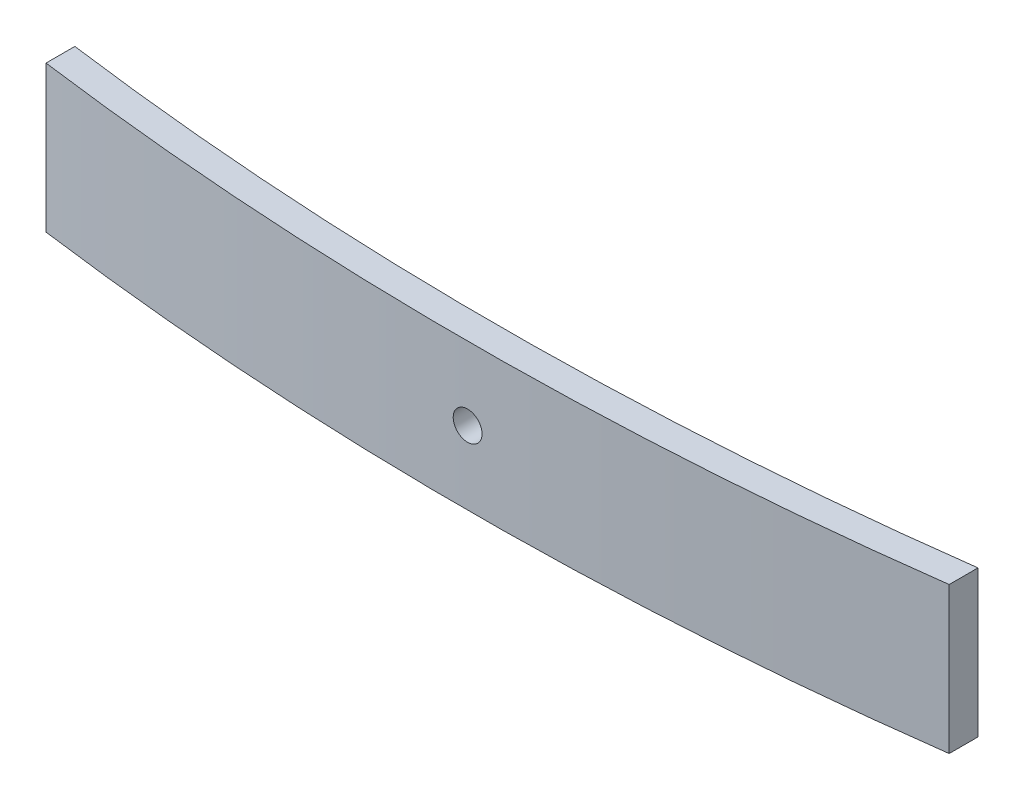
ISO-10303-21;
HEADER;
FILE_DESCRIPTION(('STEP AP214'),'2;1');
FILE_NAME('part.step','',(''),(''),'','','');
FILE_SCHEMA(('AUTOMOTIVE_DESIGN { 1 0 10303 214 1 1 1 1 }'));
ENDSEC;
DATA;
#1=APPLICATION_CONTEXT('core data for automotive mechanical design processes');
#2=APPLICATION_PROTOCOL_DEFINITION('international standard','automotive_design',2000,#1);
#3=PRODUCT_CONTEXT('',#1,'mechanical');
#4=PRODUCT('Part','Part','',(#3));
#5=PRODUCT_RELATED_PRODUCT_CATEGORY('part','',(#4));
#6=PRODUCT_DEFINITION_FORMATION('','',#4);
#7=PRODUCT_DEFINITION_CONTEXT('part definition',#1,'design');
#8=PRODUCT_DEFINITION('design','',#6,#7);
#9=PRODUCT_DEFINITION_SHAPE('','',#8);
#10=(LENGTH_UNIT() NAMED_UNIT(*) SI_UNIT(.MILLI.,.METRE.));
#11=(NAMED_UNIT(*) PLANE_ANGLE_UNIT() SI_UNIT($,.RADIAN.));
#12=(NAMED_UNIT(*) SI_UNIT($,.STERADIAN.) SOLID_ANGLE_UNIT());
#13=UNCERTAINTY_MEASURE_WITH_UNIT(LENGTH_MEASURE(1.E-05),#10,'distance_accuracy_value','');
#14=(GEOMETRIC_REPRESENTATION_CONTEXT(3) GLOBAL_UNCERTAINTY_ASSIGNED_CONTEXT((#13)) GLOBAL_UNIT_ASSIGNED_CONTEXT((#10,
#11,#12)) REPRESENTATION_CONTEXT('',''));
#15=CARTESIAN_POINT('',(0.,0.,0.));
#16=DIRECTION('',(0.,0.,1.));
#17=DIRECTION('',(1.,0.,0.));
#18=AXIS2_PLACEMENT_3D('',#15,#16,#17);
#19=CARTESIAN_POINT('',(1.29699856091001E-13,76.2,-1508.04997748721));
#20=DIRECTION('',(0.,-1.,0.));
#21=DIRECTION('',(0.,0.,-1.));
#22=AXIS2_PLACEMENT_3D('',#19,#20,#21);
#23=CYLINDRICAL_SURFACE('',#22,1776.0499774872);
#24=CARTESIAN_POINT('',(1.29699856091001E-13,0.,-1508.04997748721));
#25=DIRECTION('',(0.,1.,0.));
#26=DIRECTION('',(0.,0.,1.));
#27=AXIS2_PLACEMENT_3D('',#24,#25,#26);
#28=CIRCLE('',#27,1776.0499774872);
#29=CARTESIAN_POINT('',(235.021699517166,0.,252.381311512273));
#30=VERTEX_POINT('',#29);
#31=CARTESIAN_POINT('',(-235.021699517165,0.,252.381311512273));
#32=VERTEX_POINT('',#31);
#33=EDGE_CURVE('E122',#30,#32,#28,.F.);
#34=ORIENTED_EDGE('',*,*,#33,.F.);
#35=DIRECTION('',(0.,-1.,0.));
#36=VECTOR('',#35,1.);
#37=CARTESIAN_POINT('',(235.021699517166,76.2,252.381311512273));
#38=LINE('',#37,#36);
#39=CARTESIAN_POINT('',(235.021699517166,76.2,252.381311512273));
#40=VERTEX_POINT('',#39);
#41=EDGE_CURVE('E11',#40,#30,#38,.T.);
#42=ORIENTED_EDGE('',*,*,#41,.F.);
#43=CARTESIAN_POINT('',(1.29699856091001E-13,76.2,-1508.04997748721));
#44=DIRECTION('',(0.,1.,0.));
#45=DIRECTION('',(0.,0.,1.));
#46=AXIS2_PLACEMENT_3D('',#43,#44,#45);
#47=CIRCLE('',#46,1776.0499774872);
#48=CARTESIAN_POINT('',(-235.021699517165,76.2,252.381311512273));
#49=VERTEX_POINT('',#48);
#50=EDGE_CURVE('E115',#40,#49,#47,.F.);
#51=ORIENTED_EDGE('',*,*,#50,.T.);
#52=DIRECTION('',(0.,-1.,0.));
#53=VECTOR('',#52,1.);
#54=CARTESIAN_POINT('',(-235.021699517165,76.2,252.381311512273));
#55=LINE('',#54,#53);
#56=EDGE_CURVE('E94',#49,#32,#55,.T.);
#57=ORIENTED_EDGE('',*,*,#56,.T.);
#58=EDGE_LOOP('',(#34,#42,#51,#57));
#59=FACE_BOUND('',#58,.T.);
#60=CARTESIAN_POINT('',(1.29699856091001E-13,30.6,268.));
#61=CARTESIAN_POINT('',(-0.210713968094789,30.5999984867718,268.000000017793));
#62=CARTESIAN_POINT('',(-0.421403110930869,30.6088837241473,267.999962421727));
#63=CARTESIAN_POINT('',(-0.841354181845635,30.6443626478279,267.999813125686));
#64=CARTESIAN_POINT('',(-1.05061571988428,30.6709609920997,267.999701406219));
#65=CARTESIAN_POINT('',(-1.46633777348707,30.7417152082758,267.999406859924));
#66=CARTESIAN_POINT('',(-1.67279562512374,30.7858867143383,267.999223969782));
#67=CARTESIAN_POINT('',(-2.08132982906185,30.8914915499317,267.998792209093));
#68=CARTESIAN_POINT('',(-2.28340455125408,30.9529311869032,267.99854331444));
#69=CARTESIAN_POINT('',(-2.68152110119554,31.0925814227028,267.997986836868));
#70=CARTESIAN_POINT('',(-2.8775668723042,31.1707807807116,267.9976792933));
#71=CARTESIAN_POINT('',(-3.26237590887552,31.3434199132982,267.99701413791));
#72=CARTESIAN_POINT('',(-3.45113906456136,31.4378599325678,267.996656525334));
#73=CARTESIAN_POINT('',(-3.81998780496021,31.6422805388219,267.995901490769));
#74=CARTESIAN_POINT('',(-4.00007570143522,31.7522569546406,267.995504079474));
#75=CARTESIAN_POINT('',(-4.35035222525643,31.9869905222912,267.994680636077));
#76=CARTESIAN_POINT('',(-4.52054062300153,32.1117480167399,267.994254603313));
#77=CARTESIAN_POINT('',(-4.84979170206724,32.3751451316169,267.993386048449));
#78=CARTESIAN_POINT('',(-5.00885520931109,32.5137837196365,267.992943527577));
#79=CARTESIAN_POINT('',(-5.31479308067828,32.8040158599574,267.992054369382));
#80=CARTESIAN_POINT('',(-5.46166320475941,32.9556138817971,267.991607730686));
#81=CARTESIAN_POINT('',(-5.74206362701643,33.2705952098567,267.990723311728));
#82=CARTESIAN_POINT('',(-5.87559815641372,33.4339747494301,267.990285528692));
#83=CARTESIAN_POINT('',(-6.12847828337049,33.771463069239,267.989430939818));
#84=CARTESIAN_POINT('',(-6.24781862373923,33.9455757887633,267.989014141786));
#85=CARTESIAN_POINT('',(-6.47138111476853,34.3032005309573,267.988213616073));
#86=CARTESIAN_POINT('',(-6.57560639321551,34.4867105983519,267.987829881558));
#87=CARTESIAN_POINT('',(-6.76822875919972,34.8618615632207,267.98710627353));
#88=CARTESIAN_POINT('',(-6.85662560065947,35.0535025870461,267.986766400699));
#89=CARTESIAN_POINT('',(-7.01695887812284,35.443546097178,267.986140178144));
#90=CARTESIAN_POINT('',(-7.08889566823636,35.641948437921,267.98585382727));
#91=CARTESIAN_POINT('',(-7.21580133308614,36.0441127387919,267.985342762279));
#92=CARTESIAN_POINT('',(-7.27076981084062,36.2478748241927,267.985118049605));
#93=CARTESIAN_POINT('',(-7.36333699178478,36.659266525497,267.984736685148));
#94=CARTESIAN_POINT('',(-7.40093897454985,36.8668954034653,267.984580020515));
#95=CARTESIAN_POINT('',(-7.45853120590772,37.2846549482945,267.984339094535));
#96=CARTESIAN_POINT('',(-7.47851535225072,37.4947864564644,267.984254858275));
#97=CARTESIAN_POINT('',(-7.50070359679291,37.9159102543572,267.984161289859));
#98=CARTESIAN_POINT('',(-7.50291408330494,38.1269022075305,267.98415193079));
#99=CARTESIAN_POINT('',(-7.48955360463755,38.5484004665782,267.984208322118));
#100=CARTESIAN_POINT('',(-7.47397607404443,38.7589065643844,267.984274100247));
#101=CARTESIAN_POINT('',(-7.42514452560689,39.1778160268165,267.984478922776));
#102=CARTESIAN_POINT('',(-7.39189401428338,39.386219800212,267.984617952642));
#103=CARTESIAN_POINT('',(-7.30795445093886,39.7994886750944,267.984965325868));
#104=CARTESIAN_POINT('',(-7.25726512758627,40.00435372147,267.985173670307));
#105=CARTESIAN_POINT('',(-7.13880941808651,40.4090816554473,267.985653753506));
#106=CARTESIAN_POINT('',(-7.07104334628323,40.6089446350512,267.985925491099));
#107=CARTESIAN_POINT('',(-6.91891409978093,41.0022558470403,267.986524655178));
#108=CARTESIAN_POINT('',(-6.83455053674626,41.1957039292107,267.986852082966));
#109=CARTESIAN_POINT('',(-6.64984230973387,41.5747716673122,267.987553267696));
#110=CARTESIAN_POINT('',(-6.54950055498255,41.7603927405778,267.9879270162));
#111=CARTESIAN_POINT('',(-6.33350673998432,42.122583443866,267.988710406047));
#112=CARTESIAN_POINT('',(-6.21784939085649,42.2991499177425,267.989120059772));
#113=CARTESIAN_POINT('',(-5.97209494733969,42.6418601532707,267.989963414489));
#114=CARTESIAN_POINT('',(-5.84200303653208,42.8080076231484,267.990397106822));
#115=CARTESIAN_POINT('',(-5.56830511634727,43.1287715124287,267.99127634415));
#116=CARTESIAN_POINT('',(-5.42469413510149,43.2833836517498,267.991721893463));
#117=CARTESIAN_POINT('',(-4.97502421482191,43.7281685004763,267.993057195178));
#118=CARTESIAN_POINT('',(-4.6498630595049,43.9996590137956,267.993946551661));
#119=CARTESIAN_POINT('',(-4.13197567971228,44.3627081259288,267.995201923407));
#120=CARTESIAN_POINT('',(-3.95423770702111,44.4764002086073,267.99560743072));
#121=CARTESIAN_POINT('',(-3.58980904910956,44.6884506790732,267.996381434126));
#122=CARTESIAN_POINT('',(-3.40311815449509,44.7868087079934,267.996749929354));
#123=CARTESIAN_POINT('',(-2.83165300721097,45.0576661242204,267.99778332722));
#124=CARTESIAN_POINT('',(-2.43517114126736,45.2061693090257,267.998376934445));
#125=CARTESIAN_POINT('',(-1.6230882712456,45.434416916634,267.999304792558));
#126=CARTESIAN_POINT('',(-1.20748726904259,45.5141613461806,267.999639043471));
#127=CARTESIAN_POINT('',(-0.36880014478327,45.6027859953174,268.000011208188));
#128=CARTESIAN_POINT('',(0.0542859194178856,45.6116667624026,268.000049124282));
#129=CARTESIAN_POINT('',(0.896132618131273,45.5581931101371,267.999823726225));
#130=CARTESIAN_POINT('',(1.31489325255168,45.4958386892741,267.999560412067));
#131=CARTESIAN_POINT('',(1.93034367877395,45.350406625668,267.998962948761));
#132=CARTESIAN_POINT('',(2.13346696571784,45.2932419084602,267.998729895662));
#133=CARTESIAN_POINT('',(2.53416331768181,45.162045795966,267.998203357604));
#134=CARTESIAN_POINT('',(2.73173651249227,45.0880147954714,267.99790987406));
#135=CARTESIAN_POINT('',(3.31406084676336,44.8412313409881,267.996950242197));
#136=CARTESIAN_POINT('',(3.68878109502352,44.6437020734127,267.996204537467));
#137=CARTESIAN_POINT('',(4.22148178855396,44.302730393453,267.994991984489));
#138=CARTESIAN_POINT('',(4.39423732139202,44.1815494254651,267.99457188216));
#139=CARTESIAN_POINT('',(4.72893486876265,43.9250760102938,267.993712173886));
#140=CARTESIAN_POINT('',(4.89088085068094,43.7897887877032,267.993272575196));
#141=CARTESIAN_POINT('',(5.20283897410491,43.5060131269224,267.992386135607));
#142=CARTESIAN_POINT('',(5.35284682055937,43.357519977882,267.99193929217));
#143=CARTESIAN_POINT('',(5.63977310900408,43.0484737070593,267.991051335379));
#144=CARTESIAN_POINT('',(5.77669606337011,42.8879247771161,267.990610220096));
#145=CARTESIAN_POINT('',(6.03655633591687,42.5558335361281,267.989746002998));
#146=CARTESIAN_POINT('',(6.15949097179769,42.3842891264945,267.989322904647));
#147=CARTESIAN_POINT('',(6.39046942201546,42.0314575902559,267.98850682996));
#148=CARTESIAN_POINT('',(6.49851358458273,41.8501706916277,267.988113852918));
#149=CARTESIAN_POINT('',(6.69894774113214,41.4791360457968,267.987369158747));
#150=CARTESIAN_POINT('',(6.79133744698068,41.2893881429433,267.987017442377));
#151=CARTESIAN_POINT('',(6.9598022124246,40.9027865931224,267.986365267457));
#152=CARTESIAN_POINT('',(7.0358775259389,40.7059330568036,267.986064808109));
#153=CARTESIAN_POINT('',(7.17118720449925,40.3064792017955,267.985523618733));
#154=CARTESIAN_POINT('',(7.23041839084984,40.1038778063368,267.985282899979));
#155=CARTESIAN_POINT('',(7.33158072491748,39.6944803968452,267.98486817799));
#156=CARTESIAN_POINT('',(7.37351824975526,39.4876859585833,267.984694150164));
#157=CARTESIAN_POINT('',(7.43983858987241,39.0712246263159,267.984417572837));
#158=CARTESIAN_POINT('',(7.46421508897785,38.861556726414,267.984315049054));
#159=CARTESIAN_POINT('',(7.4952100559816,38.4409854893941,267.984184515178));
#160=CARTESIAN_POINT('',(7.50183466739309,38.2300826050053,267.984156479306));
#161=CARTESIAN_POINT('',(7.49729604901426,37.8084313167287,267.984175644233));
#162=CARTESIAN_POINT('',(7.48612970385174,37.5976829463633,267.984222858208));
#163=CARTESIAN_POINT('',(7.44608319144542,37.177881007496,267.984391205324));
#164=CARTESIAN_POINT('',(7.41720343879284,36.9688273994434,267.984512336734));
#165=CARTESIAN_POINT('',(7.34193498439912,36.5538917028773,267.984825082016));
#166=CARTESIAN_POINT('',(7.29554590651513,36.3480096825963,267.985016697403));
#167=CARTESIAN_POINT('',(7.18558954382425,35.9408886735016,267.985464967259));
#168=CARTESIAN_POINT('',(7.12202252604789,35.7396496125661,267.985721620717));
#169=CARTESIAN_POINT('',(6.97814667319727,35.3431999543688,267.986292743016));
#170=CARTESIAN_POINT('',(6.8978343085854,35.1479906380153,267.986607224044));
#171=CARTESIAN_POINT('',(6.72107980430757,34.7651040508117,267.987284909401));
#172=CARTESIAN_POINT('',(6.62464362886643,34.5774240265767,267.987648095703));
#173=CARTESIAN_POINT('',(6.41627290528497,34.2107950839366,267.988413096412));
#174=CARTESIAN_POINT('',(6.30433343128882,34.0318489650874,267.988814923082));
#175=CARTESIAN_POINT('',(6.06581689289908,33.6840847361217,267.989645553125));
#176=CARTESIAN_POINT('',(5.93924490882261,33.5152631415665,267.99007434711));
#177=CARTESIAN_POINT('',(5.67231991868899,33.1888660580893,267.990946907971));
#178=CARTESIAN_POINT('',(5.5319657052189,33.0312915565777,267.991390676156));
#179=CARTESIAN_POINT('',(5.23848659589203,32.7285285010307,267.992280544971));
#180=CARTESIAN_POINT('',(5.08536199605344,32.5833396600527,267.992726645546));
#181=CARTESIAN_POINT('',(4.76738488124472,32.3063385507568,267.993608647806));
#182=CARTESIAN_POINT('',(4.60252923302693,32.1745298791337,267.994044546725));
#183=CARTESIAN_POINT('',(4.26230143452238,31.9252727160435,267.994893638275));
#184=CARTESIAN_POINT('',(4.08692944268898,31.8078240082909,267.995306831249));
#185=CARTESIAN_POINT('',(3.72679224644603,31.5880456665328,267.996099052416));
#186=CARTESIAN_POINT('',(3.54202080718428,31.4857262485999,267.996478057458));
#187=CARTESIAN_POINT('',(3.16457932589504,31.297064106327,267.997190684132));
#188=CARTESIAN_POINT('',(2.97191219636434,31.2107155544446,267.997524322307));
#189=CARTESIAN_POINT('',(2.58015719959563,31.0546324777026,267.998136625653));
#190=CARTESIAN_POINT('',(2.38107520557346,30.984883219795,267.998415339535));
#191=CARTESIAN_POINT('',(1.97781144430165,30.8624129523238,267.998910200255));
#192=CARTESIAN_POINT('',(1.77363103212911,30.8096874689385,267.999126363529));
#193=CARTESIAN_POINT('',(1.31020489979041,30.7106430274461,267.999535351372));
#194=CARTESIAN_POINT('',(1.0499055726077,30.6691871109607,267.99970896714));
#195=CARTESIAN_POINT('',(0.526391255000487,30.6138665423076,267.999941280342));
#196=CARTESIAN_POINT('',(0.263176264592609,30.6000018899827,267.999999977777));
#197=CARTESIAN_POINT('',(1.29699856091001E-13,30.6,268.));
#198=B_SPLINE_CURVE_WITH_KNOTS('',3,(#60,#61,#62,#63,#64,#65,#66,#67,#68,#69,#70,#71,#72,#73,
#74,#75,#76,#77,#78,#79,#80,#81,#82,#83,#84,#85,#86,#87,#88,#89,#90,#91,#92,#93,#94,#95,#96,#97,
#98,#99,#100,#101,#102,#103,#104,#105,#106,#107,#108,#109,#110,#111,#112,#113,#114,#115,#116,
#117,#118,#119,#120,#121,#122,#123,#124,#125,#126,#127,#128,#129,#130,#131,#132,#133,#134,#135,
#136,#137,#138,#139,#140,#141,#142,#143,#144,#145,#146,#147,#148,#149,#150,#151,#152,#153,#154,
#155,#156,#157,#158,#159,#160,#161,#162,#163,#164,#165,#166,#167,#168,#169,#170,#171,#172,#173,
#174,#175,#176,#177,#178,#179,#180,#181,#182,#183,#184,#185,#186,#187,#188,#189,#190,#191,#192,
#193,#194,#195,#196,#197),.UNSPECIFIED.,.T.,.F.,(4,2,2,2,2,2,2,2,2,2,2,2,2,2,2,2,2,2,2,2,2,2,2,
2,2,2,2,2,2,2,2,2,2,2,2,2,2,2,2,2,2,2,2,2,2,2,2,2,2,2,2,2,2,2,2,2,2,2,2,2,2,2,2,2,2,2,2,2,4),
(0.,0.631912024301777,1.2639902864152,1.89663214600144,2.52950538839113,3.16195548087539,
3.79441510307562,4.4267052459563,5.05901004782971,5.69126785680884,6.3237446098031,
6.95602004377835,7.58852893310258,8.22090674891288,8.85329439515874,9.48566843538515,
10.1180572691842,10.7503266306474,11.3828149038618,12.0150758342728,12.6475702025455,
13.2799391235442,13.9123178840565,14.5446850047721,15.177066922899,15.8093338315781,
16.4418196509556,17.0740790696136,17.7065719276866,18.9702098092056,19.602583667419,
20.2349723230349,21.4986105469059,22.7622486468442,24.0258769838608,25.2895053477042,
25.9218869189979,26.5542536895501,27.8178774792359,28.450372115571,29.0826333187677,
29.7151209754032,30.3473897231102,30.9797795065627,31.6121544983652,32.2445411283047,
32.8769179149983,33.509413959954,34.1416765599365,34.7741664524213,35.4064374266601,
36.0388191299599,36.6711860326123,37.3035665208155,37.9359371792494,38.5684412619989,
39.2007118959496,39.8331838838019,40.4654369370645,41.097745429307,41.7300392686788,
42.3625026260201,42.9949564562123,43.6278354202829,44.2604829982539,44.892566944869,
45.5244846453389,46.3137263294984,47.1029680091573),.UNSPECIFIED.);
#199=CARTESIAN_POINT('',(1.29699856091001E-13,30.6,268.));
#200=VERTEX_POINT('',#199);
#201=EDGE_CURVE('E125',#200,#200,#198,.T.);
#202=ORIENTED_EDGE('',*,*,#201,.T.);
#203=EDGE_LOOP('',(#202));
#204=FACE_BOUND('',#203,.T.);
#205=ADVANCED_FACE('F49',(#59,#204),#23,.T.);
#206=CARTESIAN_POINT('',(1.39133536110259E-13,76.2,-1523.04997748715));
#207=DIRECTION('',(0.,-1.,0.));
#208=DIRECTION('',(0.,0.,-1.));
#209=AXIS2_PLACEMENT_3D('',#206,#207,#208);
#210=CYLINDRICAL_SURFACE('',#209,1776.04997748715);
#211=CARTESIAN_POINT('',(1.39133536110259E-13,0.,-1523.04997748715));
#212=DIRECTION('',(0.,1.,0.));
#213=DIRECTION('',(0.,0.,1.));
#214=AXIS2_PLACEMENT_3D('',#211,#212,#213);
#215=CIRCLE('',#214,1776.04997748715);
#216=CARTESIAN_POINT('',(235.021699517166,0.,237.381311512273));
#217=VERTEX_POINT('',#216);
#218=CARTESIAN_POINT('',(-235.021699517165,0.,237.381311512273));
#219=VERTEX_POINT('',#218);
#220=EDGE_CURVE('E87',#217,#219,#215,.F.);
#221=ORIENTED_EDGE('',*,*,#220,.T.);
#222=DIRECTION('',(0.,-1.,0.));
#223=VECTOR('',#222,1.);
#224=CARTESIAN_POINT('',(-235.021699517165,76.2,237.381311512273));
#225=LINE('',#224,#223);
#226=CARTESIAN_POINT('',(-235.021699517165,76.2,237.381311512273));
#227=VERTEX_POINT('',#226);
#228=EDGE_CURVE('E108',#227,#219,#225,.T.);
#229=ORIENTED_EDGE('',*,*,#228,.F.);
#230=CARTESIAN_POINT('',(1.39133536110259E-13,76.2,-1523.04997748715));
#231=DIRECTION('',(0.,1.,0.));
#232=DIRECTION('',(0.,0.,1.));
#233=AXIS2_PLACEMENT_3D('',#230,#231,#232);
#234=CIRCLE('',#233,1776.04997748715);
#235=CARTESIAN_POINT('',(235.021699517166,76.2,237.381311512273));
#236=VERTEX_POINT('',#235);
#237=EDGE_CURVE('E110',#236,#227,#234,.F.);
#238=ORIENTED_EDGE('',*,*,#237,.F.);
#239=DIRECTION('',(0.,-1.,0.));
#240=VECTOR('',#239,1.);
#241=CARTESIAN_POINT('',(235.021699517166,76.2,237.381311512273));
#242=LINE('',#241,#240);
#243=EDGE_CURVE('E64',#236,#217,#242,.T.);
#244=ORIENTED_EDGE('',*,*,#243,.T.);
#245=EDGE_LOOP('',(#221,#229,#238,#244));
#246=FACE_BOUND('',#245,.T.);
#247=CARTESIAN_POINT('',(-7.5,38.1,252.984164226377));
#248=CARTESIAN_POINT('',(-7.50000151322819,38.3107139680855,252.984164208571));
#249=CARTESIAN_POINT('',(-7.49111627585349,38.5214031109122,252.984201804954));
#250=CARTESIAN_POINT('',(-7.45563735217615,38.9413541818078,252.984351102375));
#251=CARTESIAN_POINT('',(-7.42903900790671,39.1506157198367,252.984462822905));
#252=CARTESIAN_POINT('',(-7.35828479173724,39.56633777342,252.984757371678));
#253=CARTESIAN_POINT('',(-7.31411328567894,39.7727956250468,252.984940263235));
#254=CARTESIAN_POINT('',(-7.208508450096,40.181329828965,252.985372027225));
#255=CARTESIAN_POINT('',(-7.14706881313062,40.3834045511471,252.985620923766));
#256=CARTESIAN_POINT('',(-7.00741857734594,40.781521101067,252.986177405229));
#257=CARTESIAN_POINT('',(-6.92921921934607,40.9775668721644,252.986484950802));
#258=CARTESIAN_POINT('',(-6.75658008677935,41.362375908714,252.987150110131));
#259=CARTESIAN_POINT('',(-6.66214006752074,41.5511390643896,252.987507724643));
#260=CARTESIAN_POINT('',(-6.45771946129041,41.9199878047696,252.988262762777));
#261=CARTESIAN_POINT('',(-6.34774304548433,42.1000757012362,252.988660175705));
#262=CARTESIAN_POINT('',(-6.11300947786033,42.4503522250429,252.989483621892));
#263=CARTESIAN_POINT('',(-5.98825198342546,42.6205406227819,252.989909655814));
#264=CARTESIAN_POINT('',(-5.72485486856214,42.9497917018563,252.990778212374));
#265=CARTESIAN_POINT('',(-5.5862162805409,43.1088552091137,252.991220733785));
#266=CARTESIAN_POINT('',(-5.29598414021393,43.4147930805081,252.992109892413));
#267=CARTESIAN_POINT('',(-5.14438611836974,43.5616632046028,252.992556531002));
#268=CARTESIAN_POINT('',(-4.82940479029845,43.8420636268864,252.993440949047));
#269=CARTESIAN_POINT('',(-4.66602525071788,43.9755981562967,252.993878731277));
#270=CARTESIAN_POINT('',(-4.32853693089197,44.2284782832785,252.994733317997));
#271=CARTESIAN_POINT('',(-4.15442421135789,44.3478186236592,252.99515011468));
#272=CARTESIAN_POINT('',(-3.79679946915635,44.5713811147018,252.995950637268));
#273=CARTESIAN_POINT('',(-3.61328940176486,44.6756063931513,252.996334370008));
#274=CARTESIAN_POINT('',(-3.23813843690194,44.868228759141,252.997057974284));
#275=CARTESIAN_POINT('',(-3.04649741307953,44.9566256006036,252.997397845139));
#276=CARTESIAN_POINT('',(-2.65645390295346,45.116958878073,252.998024063725));
#277=CARTESIAN_POINT('',(-2.45805156221349,45.1888956681897,252.998310412606));
#278=CARTESIAN_POINT('',(-2.05588726134913,45.3158013330459,252.998821473857));
#279=CARTESIAN_POINT('',(-1.85212517595196,45.3707698108037,252.999046184785));
#280=CARTESIAN_POINT('',(-1.44073347465677,45.4633369917546,252.999427546169));
#281=CARTESIAN_POINT('',(-1.23310459669404,45.5009389745231,252.999584209475));
#282=CARTESIAN_POINT('',(-0.815345051876459,45.5585312058889,252.999825133398));
#283=CARTESIAN_POINT('',(-0.605213543712588,45.5785153522362,252.999909368927));
#284=CARTESIAN_POINT('',(-0.184089745831485,45.6007035967881,253.000002936514));
#285=CARTESIAN_POINT('',(0.0269022073360925,45.6029140833055,253.000012295484));
#286=CARTESIAN_POINT('',(0.448400466373138,45.5895536046497,252.999955904647));
#287=CARTESIAN_POINT('',(0.658906564174368,45.5739760740628,252.999890127108));
#288=CARTESIAN_POINT('',(1.07781602663256,45.5251445256344,252.999685306357));
#289=CARTESIAN_POINT('',(1.28621980005893,45.4918940143109,252.999546277678));
#290=CARTESIAN_POINT('',(1.69948867500321,45.407954450961,252.999198907313));
#291=CARTESIAN_POINT('',(1.90435372140974,45.357265127603,252.998990564549));
#292=CARTESIAN_POINT('',(2.30908165544806,45.2388094180872,252.998510484954));
#293=CARTESIAN_POINT('',(2.50894463508202,45.1710433462732,252.998238749291));
#294=CARTESIAN_POINT('',(2.90225584712974,45.0189140997444,252.997639589154));
#295=CARTESIAN_POINT('',(3.09570392932878,44.9345505366938,252.997312163378));
#296=CARTESIAN_POINT('',(3.47477166746599,44.7498423096539,252.996610982501));
#297=CARTESIAN_POINT('',(3.6603927407395,44.6495005548925,252.996237235837));
#298=CARTESIAN_POINT('',(4.02258344404181,44.433506739873,252.99545384932));
#299=CARTESIAN_POINT('',(4.1991499179246,44.3178493907339,252.995044197084));
#300=CARTESIAN_POINT('',(4.54186015346291,44.0720949471939,252.994200844778));
#301=CARTESIAN_POINT('',(4.70800762334451,43.9420030363744,252.993767153369));
#302=CARTESIAN_POINT('',(5.02877151263007,43.6683051161658,252.992887917265));
#303=CARTESIAN_POINT('',(5.18338365195258,43.524694134908,252.992442368252));
#304=CARTESIAN_POINT('',(5.62816850065028,43.075024214623,252.991107066408));
#305=CARTESIAN_POINT('',(5.89965901394052,42.7498630593184,252.990217708469));
#306=CARTESIAN_POINT('',(6.26270812603403,42.231975679552,252.988962332908));
#307=CARTESIAN_POINT('',(6.37640020870003,42.0542377068708,252.988556824049));
#308=CARTESIAN_POINT('',(6.58845067914274,41.689809048981,252.987782817221));
#309=CARTESIAN_POINT('',(6.68680870805227,41.5031181543784,252.987414320118));
#310=CARTESIAN_POINT('',(6.95766612427186,40.9316530070874,252.986380916429));
#311=CARTESIAN_POINT('',(7.1061693090764,40.5351711411231,252.985787305057));
#312=CARTESIAN_POINT('',(7.33441691667697,39.7230882710565,252.98485943989));
#313=CARTESIAN_POINT('',(7.4141613462167,39.3074872688294,252.98452518607));
#314=CARTESIAN_POINT('',(7.50278599532745,38.4688001445599,252.98415301811));
#315=CARTESIAN_POINT('',(7.51166676240022,38.0457140803735,252.984115101681));
#316=CARTESIAN_POINT('',(7.45819311011506,37.2038673816925,252.984340501734));
#317=CARTESIAN_POINT('',(7.39583868924482,36.7851067472898,252.984603818221));
#318=CARTESIAN_POINT('',(7.25040662563846,36.1696563211186,252.985201286275));
#319=CARTESIAN_POINT('',(7.19324190843678,35.9665330342062,252.985434341165));
#320=CARTESIAN_POINT('',(7.06204579596008,35.5658366823044,252.98596088302));
#321=CARTESIAN_POINT('',(6.988014795477,35.3682634875246,252.986254368569));
#322=CARTESIAN_POINT('',(6.74123134103598,34.7859391533421,252.987214006388));
#323=CARTESIAN_POINT('',(6.54370207349932,34.4112189051374,252.987959715012));
#324=CARTESIAN_POINT('',(6.20273039359089,33.8785182116486,252.98917227251));
#325=CARTESIAN_POINT('',(6.08154942560718,33.7057626788045,252.989592376125));
#326=CARTESIAN_POINT('',(5.82507601044284,33.3710651314208,252.990452086404));
#327=CARTESIAN_POINT('',(5.68978878785504,33.2091191494955,252.990891685812));
#328=CARTESIAN_POINT('',(5.40601312707813,32.8971610260567,252.991778126146));
#329=CARTESIAN_POINT('',(5.25751997803879,32.7471531795944,252.99222496961));
#330=CARTESIAN_POINT('',(4.94847370721621,32.4602268911334,252.993112925805));
#331=CARTESIAN_POINT('',(4.78792477727201,32.3233039367589,252.993554040465));
#332=CARTESIAN_POINT('',(4.45583353628019,32.0634436641952,252.994418255711));
#333=CARTESIAN_POINT('',(4.28428912664369,31.9405090283059,252.994841352831));
#334=CARTESIAN_POINT('',(3.93145759039771,31.7095305780716,252.995657424618));
#335=CARTESIAN_POINT('',(3.75017069176505,31.6014864154963,252.996050399988));
#336=CARTESIAN_POINT('',(3.37913604592412,31.4010522589318,252.99679509052));
#337=CARTESIAN_POINT('',(3.18938814306503,31.3086625530763,252.997146804922));
#338=CARTESIAN_POINT('',(2.80278659323259,31.1401977876195,252.997798975874));
#339=CARTESIAN_POINT('',(2.60593305690779,31.0641224740995,252.998099433222));
#340=CARTESIAN_POINT('',(2.20647920190445,30.9288127955346,252.998640618766));
#341=CARTESIAN_POINT('',(2.00387780645707,30.8695816091838,252.998881335688));
#342=CARTESIAN_POINT('',(1.59448039698904,30.7684192751141,252.999296054415));
#343=CARTESIAN_POINT('',(1.38768595873948,30.7264817502745,252.99947008081));
#344=CARTESIAN_POINT('',(0.971224626496979,30.6601614101516,252.999746655793));
#345=CARTESIAN_POINT('',(0.761556726607799,30.6357849110423,252.999849178662));
#346=CARTESIAN_POINT('',(0.340985489613207,30.6047899440287,252.999979711378));
#347=CARTESIAN_POINT('',(0.130082605237183,30.5981653326113,253.000007747002));
#348=CARTESIAN_POINT('',(-0.2915686830487,30.6027039509765,252.999988582247));
#349=CARTESIAN_POINT('',(-0.502317053436057,30.6138702961342,252.99994136869));
#350=CARTESIAN_POINT('',(-0.92211899234788,30.6539168085346,252.999773023056));
#351=CARTESIAN_POINT('',(-1.13117260042308,30.6827965611861,252.99965189271));
#352=CARTESIAN_POINT('',(-1.54610829703443,30.7580650155817,252.999339150039));
#353=CARTESIAN_POINT('',(-1.75199031733826,30.8044540934685,252.9991475362));
#354=CARTESIAN_POINT('',(-2.15911132647842,30.9144104561691,252.998699269789));
#355=CARTESIAN_POINT('',(-2.36035038743661,30.9779774739523,252.998442618228));
#356=CARTESIAN_POINT('',(-2.75680004567823,31.1218533268206,252.997871499833));
#357=CARTESIAN_POINT('',(-2.95200936205342,31.2021656914433,252.997557020813));
#358=CARTESIAN_POINT('',(-3.33489594929877,31.3789201957465,252.99687933939));
#359=CARTESIAN_POINT('',(-3.52257597355381,31.4753563712022,252.996516155014));
#360=CARTESIAN_POINT('',(-3.88920491623114,31.6837270948159,252.995751157795));
#361=CARTESIAN_POINT('',(-4.06815103509762,31.7956665688298,252.995349332688));
#362=CARTESIAN_POINT('',(-4.41591526409443,32.0341831072574,252.994518705298));
#363=CARTESIAN_POINT('',(-4.58473685866347,32.1607550913541,252.994089912401));
#364=CARTESIAN_POINT('',(-4.9111339421384,32.4276800815085,252.993217353088));
#365=CARTESIAN_POINT('',(-5.0687084436356,32.568034294977,252.992773585362));
#366=CARTESIAN_POINT('',(-5.37147149915389,32.8615134042977,252.991883716795));
#367=CARTESIAN_POINT('',(-5.51666034011747,33.0146380041317,252.991437616009));
#368=CARTESIAN_POINT('',(-5.79366144938522,33.3326151189285,252.99055561267));
#369=CARTESIAN_POINT('',(-5.9254701209946,33.4974707671389,252.990119712884));
#370=CARTESIAN_POINT('',(-6.17472728405847,33.8376985656261,252.989270619054));
#371=CARTESIAN_POINT('',(-6.29217599179848,34.0130705574494,252.988857424669));
#372=CARTESIAN_POINT('',(-6.51195433354262,34.3732077536857,252.988065200255));
#373=CARTESIAN_POINT('',(-6.61427375147285,34.5579791929515,252.987686193377));
#374=CARTESIAN_POINT('',(-6.80293589374009,34.935420674249,252.986973562955));
#375=CARTESIAN_POINT('',(-6.88928444561939,35.1280878037838,252.986639922868));
#376=CARTESIAN_POINT('',(-7.04536752235469,35.5198428005607,252.98602761556));
#377=CARTESIAN_POINT('',(-7.11511678025875,35.7189247945869,252.985748899626));
#378=CARTESIAN_POINT('',(-7.23758704772251,36.1221885558675,252.985254035172));
#379=CARTESIAN_POINT('',(-7.29031253110392,36.3263689680447,252.985037870214));
#380=CARTESIAN_POINT('',(-7.38935697257925,36.789795100359,252.984628879072));
#381=CARTESIAN_POINT('',(-7.43081288905515,37.0500944275119,252.984455261811));
#382=CARTESIAN_POINT('',(-7.48613345769553,37.5736087450595,252.984222946583));
#383=CARTESIAN_POINT('',(-7.49999811001735,37.8368237354374,252.984164248616));
#384=CARTESIAN_POINT('',(-7.5,38.1,252.984164226377));
#385=B_SPLINE_CURVE_WITH_KNOTS('',3,(#247,#248,#249,#250,#251,#252,#253,#254,#255,#256,#257,
#258,#259,#260,#261,#262,#263,#264,#265,#266,#267,#268,#269,#270,#271,#272,#273,#274,#275,#276,
#277,#278,#279,#280,#281,#282,#283,#284,#285,#286,#287,#288,#289,#290,#291,#292,#293,#294,#295,
#296,#297,#298,#299,#300,#301,#302,#303,#304,#305,#306,#307,#308,#309,#310,#311,#312,#313,#314,
#315,#316,#317,#318,#319,#320,#321,#322,#323,#324,#325,#326,#327,#328,#329,#330,#331,#332,#333,
#334,#335,#336,#337,#338,#339,#340,#341,#342,#343,#344,#345,#346,#347,#348,#349,#350,#351,#352,
#353,#354,#355,#356,#357,#358,#359,#360,#361,#362,#363,#364,#365,#366,#367,#368,#369,#370,#371,
#372,#373,#374,#375,#376,#377,#378,#379,#380,#381,#382,#383,#384),.UNSPECIFIED.,.T.,.F.,(4,2,2,
2,2,2,2,2,2,2,2,2,2,2,2,2,2,2,2,2,2,2,2,2,2,2,2,2,2,2,2,2,2,2,2,2,2,2,2,2,2,2,2,2,2,2,2,2,2,2,2,
2,2,2,2,2,2,2,2,2,2,2,2,2,2,2,2,2,4),(0.,0.631912024273445,1.26399028635864,1.89663214591711,
2.52950538827904,3.16195548073079,3.79441510289857,4.42670524574721,5.05901004758862,
5.69126785660492,6.32374460963637,6.95602004364789,7.58852893300835,8.22090674880479,
8.85329439503679,9.48566843524988,10.1180572690357,10.7503266304816,11.3828149036786,
12.015075834073,12.6475702023291,13.2799391234167,13.9123178840178,14.5446850048214,
15.1770669230362,15.8093338317406,16.4418196511433,17.0740790698267,17.7065719279251,
18.9702098093707,19.6025836675478,20.2349723231275,21.4986105470723,22.7622486470823,
24.0258769840529,25.2895053478503,25.9218869190543,26.554253689517,27.8178774790259,
28.4503721153762,29.0826333185882,29.7151209752384,30.3473897229599,30.9797795064268,
31.6121544982437,32.2445411281974,32.8769179149055,33.5094139598227,34.1416765597669,
34.7741664522143,35.4064374264159,36.0388191297804,36.6711860324976,37.3035665207648,
37.9359371792628,38.5684412620756,39.2007118960894,39.8331838840045,40.4654369373298,
41.0977454295341,41.7300392688676,42.3625026261715,42.9949564563263,43.6278354204137,
44.2604829984014,44.8925669450324,45.5244846455181,46.313726329588,47.1029680091571),.UNSPECIFIED.);
#386=CARTESIAN_POINT('',(-7.5,38.1,252.984164226377));
#387=VERTEX_POINT('',#386);
#388=EDGE_CURVE('E53',#387,#387,#385,.T.);
#389=ORIENTED_EDGE('',*,*,#388,.F.);
#390=EDGE_LOOP('',(#389));
#391=FACE_BOUND('',#390,.T.);
#392=ADVANCED_FACE('F111',(#246,#391),#210,.F.);
#393=CARTESIAN_POINT('',(235.021699517166,76.2,0.));
#394=DIRECTION('',(1.,0.,0.));
#395=DIRECTION('',(0.,0.,-1.));
#396=AXIS2_PLACEMENT_3D('',#393,#394,#395);
#397=PLANE('',#396);
#398=DIRECTION('',(0.,0.,1.));
#399=VECTOR('',#398,1.);
#400=CARTESIAN_POINT('',(235.021699517166,0.,0.));
#401=LINE('',#400,#399);
#402=EDGE_CURVE('E107',#217,#30,#401,.T.);
#403=ORIENTED_EDGE('',*,*,#402,.F.);
#404=ORIENTED_EDGE('',*,*,#243,.F.);
#405=DIRECTION('',(0.,0.,1.));
#406=VECTOR('',#405,1.);
#407=CARTESIAN_POINT('',(235.021699517166,76.2,0.));
#408=LINE('',#407,#406);
#409=EDGE_CURVE('E105',#236,#40,#408,.T.);
#410=ORIENTED_EDGE('',*,*,#409,.T.);
#411=ORIENTED_EDGE('',*,*,#41,.T.);
#412=EDGE_LOOP('',(#403,#404,#410,#411));
#413=FACE_BOUND('',#412,.T.);
#414=ADVANCED_FACE('F103',(#413),#397,.T.);
#415=CARTESIAN_POINT('',(-235.021699517165,76.2,0.));
#416=DIRECTION('',(1.,0.,0.));
#417=DIRECTION('',(0.,0.,-1.));
#418=AXIS2_PLACEMENT_3D('',#415,#416,#417);
#419=PLANE('',#418);
#420=DIRECTION('',(0.,0.,1.));
#421=VECTOR('',#420,1.);
#422=CARTESIAN_POINT('',(-235.021699517165,0.,0.));
#423=LINE('',#422,#421);
#424=EDGE_CURVE('E117',#219,#32,#423,.T.);
#425=ORIENTED_EDGE('',*,*,#424,.T.);
#426=ORIENTED_EDGE('',*,*,#56,.F.);
#427=DIRECTION('',(0.,0.,1.));
#428=VECTOR('',#427,1.);
#429=CARTESIAN_POINT('',(-235.021699517165,76.2,0.));
#430=LINE('',#429,#428);
#431=EDGE_CURVE('E72',#227,#49,#430,.T.);
#432=ORIENTED_EDGE('',*,*,#431,.F.);
#433=ORIENTED_EDGE('',*,*,#228,.T.);
#434=EDGE_LOOP('',(#425,#426,#432,#433));
#435=FACE_BOUND('',#434,.T.);
#436=ADVANCED_FACE('F132',(#435),#419,.F.);
#437=CARTESIAN_POINT('',(0.,76.2,0.));
#438=DIRECTION('',(0.,1.,0.));
#439=DIRECTION('',(0.,0.,1.));
#440=AXIS2_PLACEMENT_3D('',#437,#438,#439);
#441=PLANE('',#440);
#442=ORIENTED_EDGE('',*,*,#50,.F.);
#443=ORIENTED_EDGE('',*,*,#409,.F.);
#444=ORIENTED_EDGE('',*,*,#237,.T.);
#445=ORIENTED_EDGE('',*,*,#431,.T.);
#446=EDGE_LOOP('',(#442,#443,#444,#445));
#447=FACE_BOUND('',#446,.T.);
#448=ADVANCED_FACE('F114',(#447),#441,.T.);
#449=CARTESIAN_POINT('',(0.,0.,0.));
#450=DIRECTION('',(0.,1.,0.));
#451=DIRECTION('',(0.,0.,1.));
#452=AXIS2_PLACEMENT_3D('',#449,#450,#451);
#453=PLANE('',#452);
#454=ORIENTED_EDGE('',*,*,#33,.T.);
#455=ORIENTED_EDGE('',*,*,#424,.F.);
#456=ORIENTED_EDGE('',*,*,#220,.F.);
#457=ORIENTED_EDGE('',*,*,#402,.T.);
#458=EDGE_LOOP('',(#454,#455,#456,#457));
#459=FACE_BOUND('',#458,.T.);
#460=ADVANCED_FACE('F134',(#459),#453,.F.);
#461=CARTESIAN_POINT('',(0.,38.1,268.));
#462=DIRECTION('',(0.,0.,-1.));
#463=DIRECTION('',(-1.,0.,0.));
#464=AXIS2_PLACEMENT_3D('',#461,#462,#463);
#465=CYLINDRICAL_SURFACE('',#464,7.5);
#466=ORIENTED_EDGE('',*,*,#201,.F.);
#467=EDGE_LOOP('',(#466));
#468=FACE_BOUND('',#467,.T.);
#469=ORIENTED_EDGE('',*,*,#388,.T.);
#470=EDGE_LOOP('',(#469));
#471=FACE_BOUND('',#470,.T.);
#472=ADVANCED_FACE('F144',(#468,#471),#465,.F.);
#473=CLOSED_SHELL('',(#205,#392,#414,#436,#448,#460,#472));
#474=MANIFOLD_SOLID_BREP('B2',#473);
#475=ADVANCED_BREP_SHAPE_REPRESENTATION('',(#18,#474),#14);
#476=SHAPE_DEFINITION_REPRESENTATION(#9,#475);
ENDSEC;
END-ISO-10303-21;
